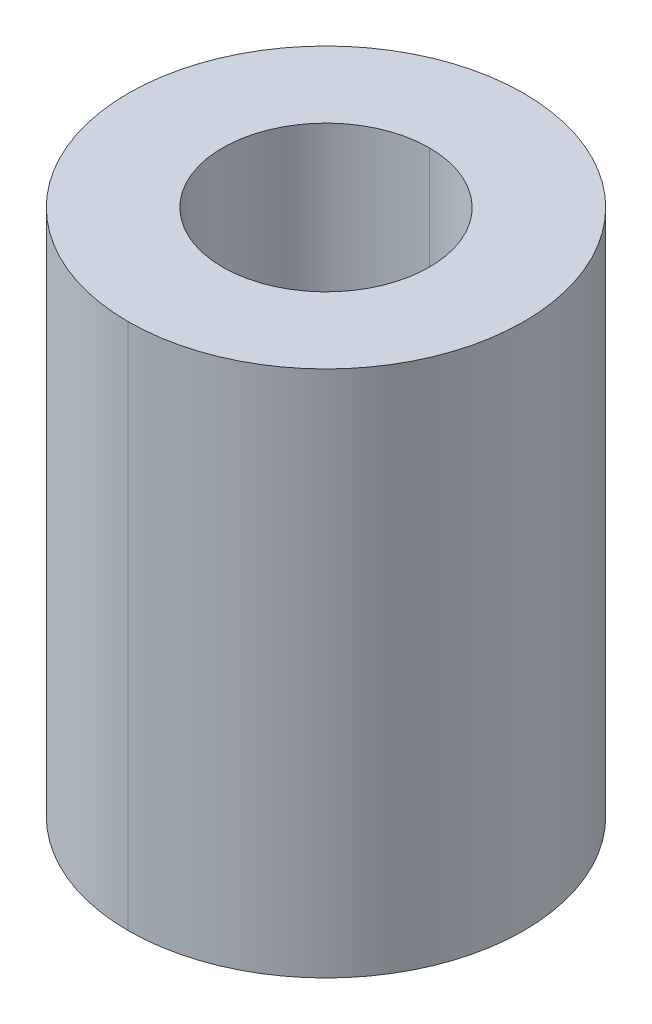
ISO-10303-21;
HEADER;
FILE_DESCRIPTION(('STEP AP214'),'2;1');
FILE_NAME('part.step','',(''),(''),'','','');
FILE_SCHEMA(('AUTOMOTIVE_DESIGN { 1 0 10303 214 1 1 1 1 }'));
ENDSEC;
DATA;
#1=APPLICATION_CONTEXT('core data for automotive mechanical design processes');
#2=APPLICATION_PROTOCOL_DEFINITION('international standard','automotive_design',2000,#1);
#3=PRODUCT_CONTEXT('',#1,'mechanical');
#4=PRODUCT('Part','Part','',(#3));
#5=PRODUCT_RELATED_PRODUCT_CATEGORY('part','',(#4));
#6=PRODUCT_DEFINITION_FORMATION('','',#4);
#7=PRODUCT_DEFINITION_CONTEXT('part definition',#1,'design');
#8=PRODUCT_DEFINITION('design','',#6,#7);
#9=PRODUCT_DEFINITION_SHAPE('','',#8);
#10=(LENGTH_UNIT() NAMED_UNIT(*) SI_UNIT(.MILLI.,.METRE.));
#11=(NAMED_UNIT(*) PLANE_ANGLE_UNIT() SI_UNIT($,.RADIAN.));
#12=(NAMED_UNIT(*) SI_UNIT($,.STERADIAN.) SOLID_ANGLE_UNIT());
#13=UNCERTAINTY_MEASURE_WITH_UNIT(LENGTH_MEASURE(1.E-05),#10,'distance_accuracy_value','');
#14=(GEOMETRIC_REPRESENTATION_CONTEXT(3) GLOBAL_UNCERTAINTY_ASSIGNED_CONTEXT((#13)) GLOBAL_UNIT_ASSIGNED_CONTEXT((#10,
#11,#12)) REPRESENTATION_CONTEXT('',''));
#15=CARTESIAN_POINT('',(0.,0.,0.));
#16=DIRECTION('',(0.,0.,1.));
#17=DIRECTION('',(1.,0.,0.));
#18=AXIS2_PLACEMENT_3D('',#15,#16,#17);
#19=CARTESIAN_POINT('',(0.,-6.35,0.));
#20=DIRECTION('',(0.,1.,0.));
#21=DIRECTION('',(0.,0.,1.));
#22=AXIS2_PLACEMENT_3D('',#19,#20,#21);
#23=CYLINDRICAL_SURFACE('',#22,2.4892);
#24=DIRECTION('',(0.,1.,0.));
#25=VECTOR('',#24,1.);
#26=CARTESIAN_POINT('',(0.,-6.35,-2.4892));
#27=LINE('',#26,#25);
#28=CARTESIAN_POINT('',(0.,-6.35,-2.4892));
#29=VERTEX_POINT('',#28);
#30=CARTESIAN_POINT('',(0.,6.35,-2.4892));
#31=VERTEX_POINT('',#30);
#32=EDGE_CURVE('E85',#29,#31,#27,.T.);
#33=ORIENTED_EDGE('',*,*,#32,.F.);
#34=CARTESIAN_POINT('',(0.,-6.35,0.));
#35=DIRECTION('',(0.,-1.,0.));
#36=DIRECTION('',(0.,0.,-1.));
#37=AXIS2_PLACEMENT_3D('',#34,#35,#36);
#38=CIRCLE('',#37,2.4892);
#39=CARTESIAN_POINT('',(0.,-6.35,2.4892));
#40=VERTEX_POINT('',#39);
#41=EDGE_CURVE('E11',#29,#40,#38,.T.);
#42=ORIENTED_EDGE('',*,*,#41,.T.);
#43=DIRECTION('',(0.,1.,0.));
#44=VECTOR('',#43,1.);
#45=CARTESIAN_POINT('',(0.,-6.35,2.4892));
#46=LINE('',#45,#44);
#47=CARTESIAN_POINT('',(0.,6.35,2.4892));
#48=VERTEX_POINT('',#47);
#49=EDGE_CURVE('E94',#40,#48,#46,.T.);
#50=ORIENTED_EDGE('',*,*,#49,.T.);
#51=CARTESIAN_POINT('',(0.,6.35,0.));
#52=DIRECTION('',(0.,-1.,0.));
#53=DIRECTION('',(0.,0.,-1.));
#54=AXIS2_PLACEMENT_3D('',#51,#52,#53);
#55=CIRCLE('',#54,2.4892);
#56=EDGE_CURVE('E86',#31,#48,#55,.T.);
#57=ORIENTED_EDGE('',*,*,#56,.F.);
#58=EDGE_LOOP('',(#33,#42,#50,#57));
#59=FACE_BOUND('',#58,.T.);
#60=ADVANCED_FACE('F17',(#59),#23,.F.);
#61=CARTESIAN_POINT('',(0.,-6.35,0.));
#62=DIRECTION('',(0.,1.,0.));
#63=DIRECTION('',(0.,0.,1.));
#64=AXIS2_PLACEMENT_3D('',#61,#62,#63);
#65=CYLINDRICAL_SURFACE('',#64,4.7625);
#66=DIRECTION('',(0.,1.,0.));
#67=VECTOR('',#66,1.);
#68=CARTESIAN_POINT('',(0.,-6.35,-4.7625));
#69=LINE('',#68,#67);
#70=CARTESIAN_POINT('',(0.,-6.35,-4.7625));
#71=VERTEX_POINT('',#70);
#72=CARTESIAN_POINT('',(0.,6.35,-4.7625));
#73=VERTEX_POINT('',#72);
#74=EDGE_CURVE('E109',#71,#73,#69,.T.);
#75=ORIENTED_EDGE('',*,*,#74,.F.);
#76=CARTESIAN_POINT('',(0.,-6.35,0.));
#77=DIRECTION('',(0.,-1.,0.));
#78=DIRECTION('',(0.,0.,-1.));
#79=AXIS2_PLACEMENT_3D('',#76,#77,#78);
#80=CIRCLE('',#79,4.7625);
#81=CARTESIAN_POINT('',(0.,-6.35,4.7625));
#82=VERTEX_POINT('',#81);
#83=EDGE_CURVE('E26',#82,#71,#80,.T.);
#84=ORIENTED_EDGE('',*,*,#83,.F.);
#85=DIRECTION('',(0.,1.,0.));
#86=VECTOR('',#85,1.);
#87=CARTESIAN_POINT('',(0.,-6.35,4.7625));
#88=LINE('',#87,#86);
#89=CARTESIAN_POINT('',(0.,6.35,4.7625));
#90=VERTEX_POINT('',#89);
#91=EDGE_CURVE('E105',#82,#90,#88,.T.);
#92=ORIENTED_EDGE('',*,*,#91,.T.);
#93=CARTESIAN_POINT('',(0.,6.35,0.));
#94=DIRECTION('',(0.,-1.,0.));
#95=DIRECTION('',(0.,0.,-1.));
#96=AXIS2_PLACEMENT_3D('',#93,#94,#95);
#97=CIRCLE('',#96,4.7625);
#98=EDGE_CURVE('E38',#90,#73,#97,.T.);
#99=ORIENTED_EDGE('',*,*,#98,.T.);
#100=EDGE_LOOP('',(#75,#84,#92,#99));
#101=FACE_BOUND('',#100,.T.);
#102=ADVANCED_FACE('F217',(#101),#65,.T.);
#103=CARTESIAN_POINT('',(0.,-6.35,0.));
#104=DIRECTION('',(0.,-1.,0.));
#105=DIRECTION('',(0.,0.,-1.));
#106=AXIS2_PLACEMENT_3D('',#103,#104,#105);
#107=PLANE('',#106);
#108=CARTESIAN_POINT('',(0.,-6.35,0.));
#109=DIRECTION('',(0.,-1.,0.));
#110=DIRECTION('',(0.,0.,-1.));
#111=AXIS2_PLACEMENT_3D('',#108,#109,#110);
#112=CIRCLE('',#111,2.4892);
#113=EDGE_CURVE('E83',#40,#29,#112,.T.);
#114=ORIENTED_EDGE('',*,*,#113,.F.);
#115=ORIENTED_EDGE('',*,*,#41,.F.);
#116=EDGE_LOOP('',(#114,#115));
#117=FACE_BOUND('',#116,.T.);
#118=ORIENTED_EDGE('',*,*,#83,.T.);
#119=CARTESIAN_POINT('',(0.,-6.35,0.));
#120=DIRECTION('',(0.,-1.,0.));
#121=DIRECTION('',(0.,0.,-1.));
#122=AXIS2_PLACEMENT_3D('',#119,#120,#121);
#123=CIRCLE('',#122,4.7625);
#124=EDGE_CURVE('E106',#71,#82,#123,.T.);
#125=ORIENTED_EDGE('',*,*,#124,.T.);
#126=EDGE_LOOP('',(#118,#125));
#127=FACE_BOUND('',#126,.T.);
#128=ADVANCED_FACE('F81',(#117,#127),#107,.T.);
#129=CARTESIAN_POINT('',(0.,6.35,0.));
#130=DIRECTION('',(0.,-1.,0.));
#131=DIRECTION('',(0.,0.,-1.));
#132=AXIS2_PLACEMENT_3D('',#129,#130,#131);
#133=PLANE('',#132);
#134=CARTESIAN_POINT('',(0.,6.35,0.));
#135=DIRECTION('',(0.,-1.,0.));
#136=DIRECTION('',(0.,0.,-1.));
#137=AXIS2_PLACEMENT_3D('',#134,#135,#136);
#138=CIRCLE('',#137,2.4892);
#139=EDGE_CURVE('E91',#48,#31,#138,.T.);
#140=ORIENTED_EDGE('',*,*,#139,.T.);
#141=ORIENTED_EDGE('',*,*,#56,.T.);
#142=EDGE_LOOP('',(#140,#141));
#143=FACE_BOUND('',#142,.T.);
#144=ORIENTED_EDGE('',*,*,#98,.F.);
#145=CARTESIAN_POINT('',(0.,6.35,0.));
#146=DIRECTION('',(0.,-1.,0.));
#147=DIRECTION('',(0.,0.,-1.));
#148=AXIS2_PLACEMENT_3D('',#145,#146,#147);
#149=CIRCLE('',#148,4.7625);
#150=EDGE_CURVE('E101',#73,#90,#149,.T.);
#151=ORIENTED_EDGE('',*,*,#150,.F.);
#152=EDGE_LOOP('',(#144,#151));
#153=FACE_BOUND('',#152,.T.);
#154=ADVANCED_FACE('F200',(#143,#153),#133,.F.);
#155=CARTESIAN_POINT('',(0.,-6.35,0.));
#156=DIRECTION('',(0.,1.,0.));
#157=DIRECTION('',(0.,0.,1.));
#158=AXIS2_PLACEMENT_3D('',#155,#156,#157);
#159=CYLINDRICAL_SURFACE('',#158,4.7625);
#160=ORIENTED_EDGE('',*,*,#124,.F.);
#161=ORIENTED_EDGE('',*,*,#74,.T.);
#162=ORIENTED_EDGE('',*,*,#150,.T.);
#163=ORIENTED_EDGE('',*,*,#91,.F.);
#164=EDGE_LOOP('',(#160,#161,#162,#163));
#165=FACE_BOUND('',#164,.T.);
#166=ADVANCED_FACE('F193',(#165),#159,.T.);
#167=CARTESIAN_POINT('',(0.,-6.35,0.));
#168=DIRECTION('',(0.,1.,0.));
#169=DIRECTION('',(0.,0.,1.));
#170=AXIS2_PLACEMENT_3D('',#167,#168,#169);
#171=CYLINDRICAL_SURFACE('',#170,2.4892);
#172=ORIENTED_EDGE('',*,*,#113,.T.);
#173=ORIENTED_EDGE('',*,*,#32,.T.);
#174=ORIENTED_EDGE('',*,*,#139,.F.);
#175=ORIENTED_EDGE('',*,*,#49,.F.);
#176=EDGE_LOOP('',(#172,#173,#174,#175));
#177=FACE_BOUND('',#176,.T.);
#178=ADVANCED_FACE('F93',(#177),#171,.F.);
#179=CLOSED_SHELL('',(#60,#102,#128,#154,#166,#178));
#180=MANIFOLD_SOLID_BREP('B1',#179);
#181=ADVANCED_BREP_SHAPE_REPRESENTATION('',(#18,#180),#14);
#182=SHAPE_DEFINITION_REPRESENTATION(#9,#181);
ENDSEC;
END-ISO-10303-21;
